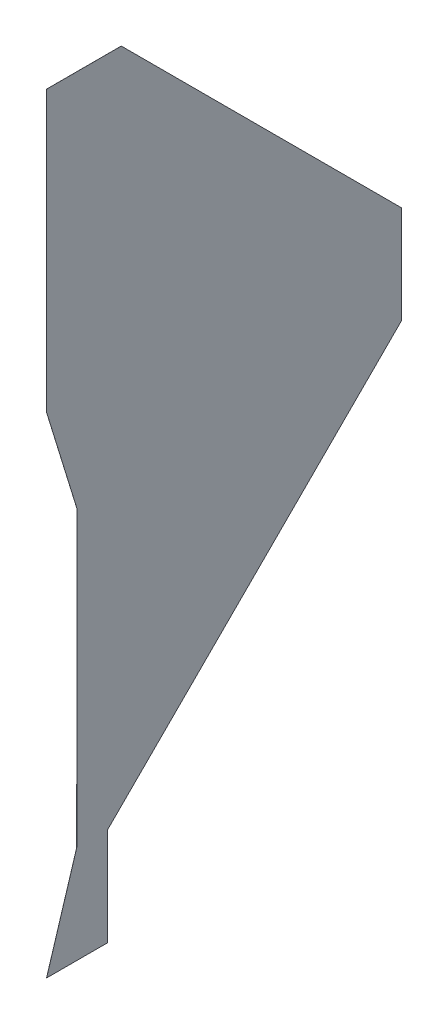
ISO-10303-21;
HEADER;
FILE_DESCRIPTION(('STEP AP214'),'2;1');
FILE_NAME('part.step','',(''),(''),'','','');
FILE_SCHEMA(('AUTOMOTIVE_DESIGN { 1 0 10303 214 1 1 1 1 }'));
ENDSEC;
DATA;
#1=APPLICATION_CONTEXT('core data for automotive mechanical design processes');
#2=APPLICATION_PROTOCOL_DEFINITION('international standard','automotive_design',2000,#1);
#3=PRODUCT_CONTEXT('',#1,'mechanical');
#4=PRODUCT('Part','Part','',(#3));
#5=PRODUCT_RELATED_PRODUCT_CATEGORY('part','',(#4));
#6=PRODUCT_DEFINITION_FORMATION('','',#4);
#7=PRODUCT_DEFINITION_CONTEXT('part definition',#1,'design');
#8=PRODUCT_DEFINITION('design','',#6,#7);
#9=PRODUCT_DEFINITION_SHAPE('','',#8);
#10=(LENGTH_UNIT() NAMED_UNIT(*) SI_UNIT(.MILLI.,.METRE.));
#11=(NAMED_UNIT(*) PLANE_ANGLE_UNIT() SI_UNIT($,.RADIAN.));
#12=(NAMED_UNIT(*) SI_UNIT($,.STERADIAN.) SOLID_ANGLE_UNIT());
#13=UNCERTAINTY_MEASURE_WITH_UNIT(LENGTH_MEASURE(1.E-05),#10,'distance_accuracy_value','');
#14=(GEOMETRIC_REPRESENTATION_CONTEXT(3) GLOBAL_UNCERTAINTY_ASSIGNED_CONTEXT((#13)) GLOBAL_UNIT_ASSIGNED_CONTEXT((#10,
#11,#12)) REPRESENTATION_CONTEXT('',''));
#15=CARTESIAN_POINT('',(0.,0.,0.));
#16=DIRECTION('',(0.,0.,1.));
#17=DIRECTION('',(1.,0.,0.));
#18=AXIS2_PLACEMENT_3D('',#15,#16,#17);
#19=CARTESIAN_POINT('',(92.300000000017,-63.468246361535,-242.836259636603));
#20=DIRECTION('',(0.,0.000285862555877771,0.999999959141299));
#21=DIRECTION('',(0.,-0.999999959141299,0.000285862555877771));
#22=AXIS2_PLACEMENT_3D('',#19,#20,#21);
#23=PLANE('',#22);
#24=DIRECTION('',(-1.,0.,0.));
#25=VECTOR('',#24,1.);
#26=CARTESIAN_POINT('',(92.300000000017,-139.647123889804,-242.814482947079));
#27=LINE('',#26,#25);
#28=CARTESIAN_POINT('',(92.310000000017,-139.647123889804,-242.814482947079));
#29=VERTEX_POINT('',#28);
#30=CARTESIAN_POINT('',(92.300000000017,-139.647123889804,-242.814482947079));
#31=VERTEX_POINT('',#30);
#32=EDGE_CURVE('E330',#29,#31,#27,.T.);
#33=ORIENTED_EDGE('',*,*,#32,.F.);
#34=DIRECTION('',(0.,-0.999999959141299,0.000285862555877771));
#35=VECTOR('',#34,1.);
#36=CARTESIAN_POINT('',(92.310000000017,-63.468246361535,-242.836259636603));
#37=LINE('',#36,#35);
#38=CARTESIAN_POINT('',(92.310000000017,-63.4871238898039,-242.836254240225));
#39=VERTEX_POINT('',#38);
#40=EDGE_CURVE('E319',#39,#29,#37,.T.);
#41=ORIENTED_EDGE('',*,*,#40,.F.);
#42=DIRECTION('',(-1.,0.,0.));
#43=VECTOR('',#42,1.);
#44=CARTESIAN_POINT('',(92.300000000017,-63.4871238898039,-242.836254240225));
#45=LINE('',#44,#43);
#46=CARTESIAN_POINT('',(92.300000000017,-63.4871238898039,-242.836254240225));
#47=VERTEX_POINT('',#46);
#48=EDGE_CURVE('E334',#39,#47,#45,.T.);
#49=ORIENTED_EDGE('',*,*,#48,.T.);
#50=DIRECTION('',(0.,-0.999999959141299,0.000285862555877771));
#51=VECTOR('',#50,1.);
#52=CARTESIAN_POINT('',(92.300000000017,-63.468246361535,-242.836259636603));
#53=LINE('',#52,#51);
#54=EDGE_CURVE('E318',#47,#31,#53,.T.);
#55=ORIENTED_EDGE('',*,*,#54,.T.);
#56=EDGE_LOOP('',(#33,#41,#49,#55));
#57=FACE_BOUND('',#56,.T.);
#58=ADVANCED_FACE('F53',(#57),#23,.T.);
#59=CARTESIAN_POINT('',(92.300000000017,-107.517123889804,-282.95964643682));
#60=DIRECTION('',(0.,-0.707106781186548,-0.707106781186547));
#61=DIRECTION('',(0.,0.707106781186547,-0.707106781186548));
#62=AXIS2_PLACEMENT_3D('',#59,#60,#61);
#63=PLANE('',#62);
#64=DIRECTION('',(-1.,0.,0.));
#65=VECTOR('',#64,1.);
#66=CARTESIAN_POINT('',(92.300000000017,-63.4871238898039,-326.98964643682));
#67=LINE('',#66,#65);
#68=CARTESIAN_POINT('',(92.310000000017,-63.4871238898039,-326.98964643682));
#69=VERTEX_POINT('',#68);
#70=CARTESIAN_POINT('',(92.300000000017,-63.4871238898039,-326.98964643682));
#71=VERTEX_POINT('',#70);
#72=EDGE_CURVE('E338',#69,#71,#67,.T.);
#73=ORIENTED_EDGE('',*,*,#72,.F.);
#74=DIRECTION('',(0.,0.707106781186547,-0.707106781186548));
#75=VECTOR('',#74,1.);
#76=CARTESIAN_POINT('',(92.310000000017,-107.517123889804,-282.95964643682));
#77=LINE('',#76,#75);
#78=CARTESIAN_POINT('',(92.310000000017,-139.647123889804,-250.82964643682));
#79=VERTEX_POINT('',#78);
#80=EDGE_CURVE('E308',#79,#69,#77,.T.);
#81=ORIENTED_EDGE('',*,*,#80,.F.);
#82=DIRECTION('',(-1.,2.80745745953666E-13,0.));
#83=VECTOR('',#82,1.);
#84=CARTESIAN_POINT('',(92.300000000017,-139.647123889804,-250.82964643682));
#85=LINE('',#84,#83);
#86=CARTESIAN_POINT('',(92.300000000017,-139.647123889804,-250.82964643682));
#87=VERTEX_POINT('',#86);
#88=EDGE_CURVE('E322',#79,#87,#85,.T.);
#89=ORIENTED_EDGE('',*,*,#88,.T.);
#90=DIRECTION('',(0.,0.707106781186547,-0.707106781186548));
#91=VECTOR('',#90,1.);
#92=CARTESIAN_POINT('',(92.300000000017,-107.517123889804,-282.95964643682));
#93=LINE('',#92,#91);
#94=EDGE_CURVE('E315',#87,#71,#93,.T.);
#95=ORIENTED_EDGE('',*,*,#94,.T.);
#96=EDGE_LOOP('',(#73,#81,#89,#95));
#97=FACE_BOUND('',#96,.T.);
#98=ADVANCED_FACE('F370',(#97),#63,.T.);
#99=CARTESIAN_POINT('',(92.300000000017,-38.1,-238.90964643682));
#100=DIRECTION('',(1.,0.,0.));
#101=DIRECTION('',(0.,1.,0.));
#102=AXIS2_PLACEMENT_3D('',#99,#100,#101);
#103=PLANE('',#102);
#104=ORIENTED_EDGE('',*,*,#54,.F.);
#105=DIRECTION('',(0.,0.967474906974961,0.252967002539442));
#106=VECTOR('',#105,1.);
#107=CARTESIAN_POINT('',(92.300000000017,-63.4871238898039,-242.836254240225));
#108=LINE('',#107,#106);
#109=CARTESIAN_POINT('',(92.300000000017,-63.463561944902,-242.83009346589));
#110=VERTEX_POINT('',#109);
#111=EDGE_CURVE('E251',#47,#110,#108,.T.);
#112=ORIENTED_EDGE('',*,*,#111,.T.);
#113=DIRECTION('',(0.,-0.95560901891625,-0.294637748711741));
#114=VECTOR('',#113,1.);
#115=CARTESIAN_POINT('',(92.300000000017,-39.1830002066171,-235.343799483297));
#116=LINE('',#115,#114);
#117=CARTESIAN_POINT('',(92.300000000017,-38.1035619449019,-235.010982135397));
#118=VERTEX_POINT('',#117);
#119=EDGE_CURVE('E241',#118,#110,#116,.T.);
#120=ORIENTED_EDGE('',*,*,#119,.F.);
#121=DIRECTION('',(0.,0.967359913062318,0.253406390211581));
#122=VECTOR('',#121,1.);
#123=CARTESIAN_POINT('',(92.300000000017,-38.103561944902,-235.010982135397));
#124=LINE('',#123,#122);
#125=CARTESIAN_POINT('',(92.300000000017,-38.08,-235.00480992656));
#126=VERTEX_POINT('',#125);
#127=EDGE_CURVE('E218',#118,#126,#124,.T.);
#128=ORIENTED_EDGE('',*,*,#127,.T.);
#129=DIRECTION('',(0.,-0.999999959141299,-0.000285862555877549));
#130=VECTOR('',#129,1.);
#131=CARTESIAN_POINT('',(92.300000000017,-38.1011162448652,-235.004815962904));
#132=LINE('',#131,#130);
#133=CARTESIAN_POINT('',(92.300000000017,34.552,-234.984047156553));
#134=VERTEX_POINT('',#133);
#135=EDGE_CURVE('E190',#134,#126,#132,.T.);
#136=ORIENTED_EDGE('',*,*,#135,.F.);
#137=DIRECTION('',(0.,0.,1.));
#138=VECTOR('',#137,1.);
#139=CARTESIAN_POINT('',(92.300000000017,34.552,-327.00964643682));
#140=LINE('',#139,#138);
#141=CARTESIAN_POINT('',(92.300000000017,34.552,-254.35764643682));
#142=VERTEX_POINT('',#141);
#143=EDGE_CURVE('E180',#142,#134,#140,.T.);
#144=ORIENTED_EDGE('',*,*,#143,.F.);
#145=DIRECTION('',(0.,0.707106781186547,0.707106781186548));
#146=VECTOR('',#145,1.);
#147=CARTESIAN_POINT('',(92.300000000017,5.94999999999998,-282.95964643682));
#148=LINE('',#147,#146);
#149=CARTESIAN_POINT('',(92.300000000017,-38.08,-326.98964643682));
#150=VERTEX_POINT('',#149);
#151=EDGE_CURVE('E174',#150,#142,#148,.T.);
#152=ORIENTED_EDGE('',*,*,#151,.F.);
#153=DIRECTION('',(0.,-0.762380675867257,-0.647128816437798));
#154=VECTOR('',#153,1.);
#155=CARTESIAN_POINT('',(92.300000000017,-38.08,-326.98964643682));
#156=LINE('',#155,#154);
#157=CARTESIAN_POINT('',(92.300000000017,-38.103561944902,-327.00964643682));
#158=VERTEX_POINT('',#157);
#159=EDGE_CURVE('E214',#150,#158,#156,.T.);
#160=ORIENTED_EDGE('',*,*,#159,.T.);
#161=DIRECTION('',(0.,1.,0.));
#162=VECTOR('',#161,1.);
#163=CARTESIAN_POINT('',(92.300000000017,-38.0835619449019,-327.00964643682));
#164=LINE('',#163,#162);
#165=CARTESIAN_POINT('',(92.300000000017,-63.463561944902,-327.00964643682));
#166=VERTEX_POINT('',#165);
#167=EDGE_CURVE('E229',#166,#158,#164,.T.);
#168=ORIENTED_EDGE('',*,*,#167,.F.);
#169=DIRECTION('',(0.,-0.762380675867861,0.647128816437086));
#170=VECTOR('',#169,1.);
#171=CARTESIAN_POINT('',(92.300000000017,-63.463561944902,-327.00964643682));
#172=LINE('',#171,#170);
#173=EDGE_CURVE('E247',#166,#71,#172,.T.);
#174=ORIENTED_EDGE('',*,*,#173,.T.);
#175=ORIENTED_EDGE('',*,*,#94,.F.);
#176=DIRECTION('',(0.,-0.762380675867256,0.647128816437798));
#177=VECTOR('',#176,1.);
#178=CARTESIAN_POINT('',(92.300000000017,-139.647123889804,-250.82964643682));
#179=LINE('',#178,#177);
#180=CARTESIAN_POINT('',(92.300000000017,-139.670685834706,-250.80964643682));
#181=VERTEX_POINT('',#180);
#182=EDGE_CURVE('E299',#87,#181,#179,.T.);
#183=ORIENTED_EDGE('',*,*,#182,.T.);
#184=DIRECTION('',(0.,1.,0.));
#185=VECTOR('',#184,1.);
#186=CARTESIAN_POINT('',(92.300000000017,-165.050685834706,-250.80964643682));
#187=LINE('',#186,#185);
#188=CARTESIAN_POINT('',(92.300000000017,-165.050685834706,-250.80964643682));
#189=VERTEX_POINT('',#188);
#190=EDGE_CURVE('E283',#189,#181,#187,.T.);
#191=ORIENTED_EDGE('',*,*,#190,.F.);
#192=DIRECTION('',(0.,0.,-1.));
#193=VECTOR('',#192,1.);
#194=CARTESIAN_POINT('',(92.300000000017,-165.050685834706,-238.90964643682));
#195=LINE('',#194,#193);
#196=CARTESIAN_POINT('',(92.300000000017,-165.050685834706,-234.983032916163));
#197=VERTEX_POINT('',#196);
#198=EDGE_CURVE('E289',#197,#189,#195,.T.);
#199=ORIENTED_EDGE('',*,*,#198,.F.);
#200=DIRECTION('',(0.,-0.95560901891625,0.294637748711741));
#201=VECTOR('',#200,1.);
#202=CARTESIAN_POINT('',(92.300000000017,-163.945114461087,-235.323907744797));
#203=LINE('',#202,#201);
#204=CARTESIAN_POINT('',(92.300000000017,-139.670685834706,-242.808310738242));
#205=VERTEX_POINT('',#204);
#206=EDGE_CURVE('E263',#205,#197,#203,.T.);
#207=ORIENTED_EDGE('',*,*,#206,.F.);
#208=DIRECTION('',(0.,0.967359913063678,-0.253406390206389));
#209=VECTOR('',#208,1.);
#210=CARTESIAN_POINT('',(92.300000000017,-139.670685834706,-242.808310738242));
#211=LINE('',#210,#209);
#212=EDGE_CURVE('E303',#205,#31,#211,.T.);
#213=ORIENTED_EDGE('',*,*,#212,.T.);
#214=EDGE_LOOP('',(#104,#112,#120,#128,#136,#144,#152,#160,#168,#174,#175,#183,#191,#199,#207,#213));
#215=FACE_BOUND('',#214,.T.);
#216=ADVANCED_FACE('F55',(#215),#103,.F.);
#217=CARTESIAN_POINT('',(92.310000000017,-63.4671238898039,-238.90964643682));
#218=DIRECTION('',(1.,0.,0.));
#219=DIRECTION('',(0.,1.,0.));
#220=AXIS2_PLACEMENT_3D('',#217,#218,#219);
#221=PLANE('',#220);
#222=ORIENTED_EDGE('',*,*,#40,.T.);
#223=DIRECTION('',(0.,0.967359913063678,-0.253406390206389));
#224=VECTOR('',#223,1.);
#225=CARTESIAN_POINT('',(92.310000000017,-139.670685834706,-242.808310738242));
#226=LINE('',#225,#224);
#227=CARTESIAN_POINT('',(92.310000000017,-139.670685834706,-242.808310738242));
#228=VERTEX_POINT('',#227);
#229=EDGE_CURVE('E304',#228,#29,#226,.T.);
#230=ORIENTED_EDGE('',*,*,#229,.F.);
#231=DIRECTION('',(0.,-0.95560901891625,0.294637748711741));
#232=VECTOR('',#231,1.);
#233=CARTESIAN_POINT('',(92.310000000017,-163.945114461087,-235.323907744797));
#234=LINE('',#233,#232);
#235=CARTESIAN_POINT('',(92.310000000017,-165.050685834706,-234.983032916163));
#236=VERTEX_POINT('',#235);
#237=EDGE_CURVE('E279',#228,#236,#234,.T.);
#238=ORIENTED_EDGE('',*,*,#237,.T.);
#239=DIRECTION('',(0.,0.,1.));
#240=VECTOR('',#239,1.);
#241=CARTESIAN_POINT('',(92.310000000017,-165.050685834706,-238.90964643682));
#242=LINE('',#241,#240);
#243=CARTESIAN_POINT('',(92.310000000017,-165.050685834706,-250.80964643682));
#244=VERTEX_POINT('',#243);
#245=EDGE_CURVE('E275',#236,#244,#242,.F.);
#246=ORIENTED_EDGE('',*,*,#245,.T.);
#247=DIRECTION('',(0.,1.,0.));
#248=VECTOR('',#247,1.);
#249=CARTESIAN_POINT('',(92.310000000017,-165.050685834706,-250.80964643682));
#250=LINE('',#249,#248);
#251=CARTESIAN_POINT('',(92.310000000017,-139.670685834706,-250.80964643682));
#252=VERTEX_POINT('',#251);
#253=EDGE_CURVE('E272',#244,#252,#250,.T.);
#254=ORIENTED_EDGE('',*,*,#253,.T.);
#255=DIRECTION('',(0.,-0.762380675867256,0.647128816437798));
#256=VECTOR('',#255,1.);
#257=CARTESIAN_POINT('',(92.310000000017,-139.647123889804,-250.82964643682));
#258=LINE('',#257,#256);
#259=EDGE_CURVE('E267',#79,#252,#258,.T.);
#260=ORIENTED_EDGE('',*,*,#259,.F.);
#261=ORIENTED_EDGE('',*,*,#80,.T.);
#262=DIRECTION('',(0.,-0.762380675867861,0.647128816437086));
#263=VECTOR('',#262,1.);
#264=CARTESIAN_POINT('',(92.3100000000169,-63.463561944902,-327.00964643682));
#265=LINE('',#264,#263);
#266=CARTESIAN_POINT('',(92.310000000017,-63.463561944902,-327.00964643682));
#267=VERTEX_POINT('',#266);
#268=EDGE_CURVE('E232',#267,#69,#265,.T.);
#269=ORIENTED_EDGE('',*,*,#268,.F.);
#270=DIRECTION('',(0.,1.,0.));
#271=VECTOR('',#270,1.);
#272=CARTESIAN_POINT('',(92.310000000017,-38.083561944902,-327.00964643682));
#273=LINE('',#272,#271);
#274=CARTESIAN_POINT('',(92.310000000017,-38.103561944902,-327.00964643682));
#275=VERTEX_POINT('',#274);
#276=EDGE_CURVE('E69',#267,#275,#273,.T.);
#277=ORIENTED_EDGE('',*,*,#276,.T.);
#278=DIRECTION('',(0.,-0.762380675867257,-0.647128816437798));
#279=VECTOR('',#278,1.);
#280=CARTESIAN_POINT('',(92.310000000017,-38.08,-326.98964643682));
#281=LINE('',#280,#279);
#282=CARTESIAN_POINT('',(92.310000000017,-38.08,-326.98964643682));
#283=VERTEX_POINT('',#282);
#284=EDGE_CURVE('E188',#283,#275,#281,.T.);
#285=ORIENTED_EDGE('',*,*,#284,.F.);
#286=DIRECTION('',(0.,0.707106781186547,0.707106781186548));
#287=VECTOR('',#286,1.);
#288=CARTESIAN_POINT('',(92.310000000017,5.94999999999998,-282.95964643682));
#289=LINE('',#288,#287);
#290=CARTESIAN_POINT('',(92.310000000017,34.552,-254.35764643682));
#291=VERTEX_POINT('',#290);
#292=EDGE_CURVE('E172',#283,#291,#289,.T.);
#293=ORIENTED_EDGE('',*,*,#292,.T.);
#294=DIRECTION('',(0.,0.,1.));
#295=VECTOR('',#294,1.);
#296=CARTESIAN_POINT('',(92.310000000017,34.552,-238.90964643682));
#297=LINE('',#296,#295);
#298=CARTESIAN_POINT('',(92.310000000017,34.552,-234.984047156553));
#299=VERTEX_POINT('',#298);
#300=EDGE_CURVE('E185',#291,#299,#297,.T.);
#301=ORIENTED_EDGE('',*,*,#300,.T.);
#302=DIRECTION('',(0.,-0.999999959141299,-0.000285862555877549));
#303=VECTOR('',#302,1.);
#304=CARTESIAN_POINT('',(92.310000000017,-38.1011162448652,-235.004815962904));
#305=LINE('',#304,#303);
#306=CARTESIAN_POINT('',(92.310000000017,-38.08,-235.00480992656));
#307=VERTEX_POINT('',#306);
#308=EDGE_CURVE('E195',#299,#307,#305,.T.);
#309=ORIENTED_EDGE('',*,*,#308,.T.);
#310=DIRECTION('',(0.,0.967359913062318,0.253406390211581));
#311=VECTOR('',#310,1.);
#312=CARTESIAN_POINT('',(92.310000000017,-38.103561944902,-235.010982135397));
#313=LINE('',#312,#311);
#314=CARTESIAN_POINT('',(92.310000000017,-38.1035619449019,-235.010982135397));
#315=VERTEX_POINT('',#314);
#316=EDGE_CURVE('E219',#315,#307,#313,.T.);
#317=ORIENTED_EDGE('',*,*,#316,.F.);
#318=DIRECTION('',(0.,-0.95560901891625,-0.294637748711741));
#319=VECTOR('',#318,1.);
#320=CARTESIAN_POINT('',(92.310000000017,-39.1830002066171,-235.343799483297));
#321=LINE('',#320,#319);
#322=CARTESIAN_POINT('',(92.3100000000169,-63.463561944902,-242.83009346589));
#323=VERTEX_POINT('',#322);
#324=EDGE_CURVE('E77',#315,#323,#321,.T.);
#325=ORIENTED_EDGE('',*,*,#324,.T.);
#326=DIRECTION('',(0.,0.967474906974961,0.252967002539442));
#327=VECTOR('',#326,1.);
#328=CARTESIAN_POINT('',(92.3100000000169,-63.4871238898039,-242.836254240225));
#329=LINE('',#328,#327);
#330=EDGE_CURVE('E252',#39,#323,#329,.T.);
#331=ORIENTED_EDGE('',*,*,#330,.F.);
#332=EDGE_LOOP('',(#222,#230,#238,#246,#254,#260,#261,#269,#277,#285,#293,#301,#309,#317,#325,#331));
#333=FACE_BOUND('',#332,.T.);
#334=ADVANCED_FACE('F184',(#333),#221,.T.);
#335=CARTESIAN_POINT('',(92.305000000017,-139.647123889804,-250.82964643682));
#336=DIRECTION('',(0.,-0.647128816437798,-0.762380675867256));
#337=DIRECTION('',(0.,-0.762380675867256,0.647128816437798));
#338=AXIS2_PLACEMENT_3D('',#335,#336,#337);
#339=PLANE('',#338);
#340=ORIENTED_EDGE('',*,*,#88,.F.);
#341=ORIENTED_EDGE('',*,*,#259,.T.);
#342=DIRECTION('',(-1.,0.,0.));
#343=VECTOR('',#342,1.);
#344=CARTESIAN_POINT('',(92.300000000017,-139.670685834706,-250.80964643682));
#345=LINE('',#344,#343);
#346=EDGE_CURVE('E256',#252,#181,#345,.T.);
#347=ORIENTED_EDGE('',*,*,#346,.T.);
#348=ORIENTED_EDGE('',*,*,#182,.F.);
#349=EDGE_LOOP('',(#340,#341,#347,#348));
#350=FACE_BOUND('',#349,.T.);
#351=ADVANCED_FACE('F380',(#350),#339,.T.);
#352=CARTESIAN_POINT('',(92.305000000017,-139.670685834706,-242.808310738242));
#353=DIRECTION('',(0.,0.253406390206389,0.967359913063678));
#354=DIRECTION('',(0.,0.967359913063678,-0.253406390206389));
#355=AXIS2_PLACEMENT_3D('',#352,#353,#354);
#356=PLANE('',#355);
#357=ORIENTED_EDGE('',*,*,#229,.T.);
#358=ORIENTED_EDGE('',*,*,#32,.T.);
#359=ORIENTED_EDGE('',*,*,#212,.F.);
#360=DIRECTION('',(-1.,0.,0.));
#361=VECTOR('',#360,1.);
#362=CARTESIAN_POINT('',(92.300000000017,-139.670685834706,-242.808310738242));
#363=LINE('',#362,#361);
#364=EDGE_CURVE('E268',#228,#205,#363,.T.);
#365=ORIENTED_EDGE('',*,*,#364,.F.);
#366=EDGE_LOOP('',(#357,#358,#359,#365));
#367=FACE_BOUND('',#366,.T.);
#368=ADVANCED_FACE('F381',(#367),#356,.T.);
#369=CARTESIAN_POINT('',(92.300000000017,-165.050685834706,-238.90964643682));
#370=DIRECTION('',(0.,-1.,0.));
#371=DIRECTION('',(0.,0.,-1.));
#372=AXIS2_PLACEMENT_3D('',#369,#370,#371);
#373=PLANE('',#372);
#374=DIRECTION('',(-1.,0.,0.));
#375=VECTOR('',#374,1.);
#376=CARTESIAN_POINT('',(92.300000000017,-165.050685834706,-250.80964643682));
#377=LINE('',#376,#375);
#378=EDGE_CURVE('E286',#244,#189,#377,.T.);
#379=ORIENTED_EDGE('',*,*,#378,.F.);
#380=ORIENTED_EDGE('',*,*,#245,.F.);
#381=DIRECTION('',(-1.,0.,0.));
#382=VECTOR('',#381,1.);
#383=CARTESIAN_POINT('',(92.300000000017,-165.050685834706,-234.983032916163));
#384=LINE('',#383,#382);
#385=EDGE_CURVE('E293',#236,#197,#384,.T.);
#386=ORIENTED_EDGE('',*,*,#385,.T.);
#387=ORIENTED_EDGE('',*,*,#198,.T.);
#388=EDGE_LOOP('',(#379,#380,#386,#387));
#389=FACE_BOUND('',#388,.T.);
#390=ADVANCED_FACE('F384',(#389),#373,.T.);
#391=CARTESIAN_POINT('',(92.300000000017,-165.050685834706,-250.80964643682));
#392=DIRECTION('',(0.,0.,-1.));
#393=DIRECTION('',(0.,1.,0.));
#394=AXIS2_PLACEMENT_3D('',#391,#392,#393);
#395=PLANE('',#394);
#396=ORIENTED_EDGE('',*,*,#346,.F.);
#397=ORIENTED_EDGE('',*,*,#253,.F.);
#398=ORIENTED_EDGE('',*,*,#378,.T.);
#399=ORIENTED_EDGE('',*,*,#190,.T.);
#400=EDGE_LOOP('',(#396,#397,#398,#399));
#401=FACE_BOUND('',#400,.T.);
#402=ADVANCED_FACE('F393',(#401),#395,.T.);
#403=CARTESIAN_POINT('',(92.300000000017,-163.945114461087,-235.323907744797));
#404=DIRECTION('',(0.,0.294637748711741,0.95560901891625));
#405=DIRECTION('',(0.,-0.95560901891625,0.294637748711741));
#406=AXIS2_PLACEMENT_3D('',#403,#404,#405);
#407=PLANE('',#406);
#408=ORIENTED_EDGE('',*,*,#385,.F.);
#409=ORIENTED_EDGE('',*,*,#237,.F.);
#410=ORIENTED_EDGE('',*,*,#364,.T.);
#411=ORIENTED_EDGE('',*,*,#206,.T.);
#412=EDGE_LOOP('',(#408,#409,#410,#411));
#413=FACE_BOUND('',#412,.T.);
#414=ADVANCED_FACE('F389',(#413),#407,.T.);
#415=CARTESIAN_POINT('',(92.3050000000169,-63.463561944902,-327.00964643682));
#416=DIRECTION('',(0.,-0.647128816437086,-0.762380675867861));
#417=DIRECTION('',(0.,-0.762380675867861,0.647128816437086));
#418=AXIS2_PLACEMENT_3D('',#415,#416,#417);
#419=PLANE('',#418);
#420=DIRECTION('',(-1.,-6.93728578126605E-13,0.));
#421=VECTOR('',#420,1.);
#422=CARTESIAN_POINT('',(92.300000000017,-63.463561944902,-327.00964643682));
#423=LINE('',#422,#421);
#424=EDGE_CURVE('E233',#267,#166,#423,.T.);
#425=ORIENTED_EDGE('',*,*,#424,.F.);
#426=ORIENTED_EDGE('',*,*,#268,.T.);
#427=ORIENTED_EDGE('',*,*,#72,.T.);
#428=ORIENTED_EDGE('',*,*,#173,.F.);
#429=EDGE_LOOP('',(#425,#426,#427,#428));
#430=FACE_BOUND('',#429,.T.);
#431=ADVANCED_FACE('F392',(#430),#419,.T.);
#432=CARTESIAN_POINT('',(92.305000000017,-63.4871238898039,-242.836254240225));
#433=DIRECTION('',(0.,-0.252967002539442,0.967474906974961));
#434=DIRECTION('',(0.,0.967474906974961,0.252967002539442));
#435=AXIS2_PLACEMENT_3D('',#432,#433,#434);
#436=PLANE('',#435);
#437=ORIENTED_EDGE('',*,*,#330,.T.);
#438=DIRECTION('',(-1.,0.,0.));
#439=VECTOR('',#438,1.);
#440=CARTESIAN_POINT('',(92.300000000017,-63.463561944902,-242.83009346589));
#441=LINE('',#440,#439);
#442=EDGE_CURVE('E223',#323,#110,#441,.T.);
#443=ORIENTED_EDGE('',*,*,#442,.T.);
#444=ORIENTED_EDGE('',*,*,#111,.F.);
#445=ORIENTED_EDGE('',*,*,#48,.F.);
#446=EDGE_LOOP('',(#437,#443,#444,#445));
#447=FACE_BOUND('',#446,.T.);
#448=ADVANCED_FACE('F355',(#447),#436,.T.);
#449=CARTESIAN_POINT('',(92.300000000017,-39.1830002066171,-235.343799483297));
#450=DIRECTION('',(0.,-0.294637748711741,0.95560901891625));
#451=DIRECTION('',(0.,-0.95560901891625,-0.294637748711741));
#452=AXIS2_PLACEMENT_3D('',#449,#450,#451);
#453=PLANE('',#452);
#454=ORIENTED_EDGE('',*,*,#442,.F.);
#455=ORIENTED_EDGE('',*,*,#324,.F.);
#456=DIRECTION('',(-1.,0.,0.));
#457=VECTOR('',#456,1.);
#458=CARTESIAN_POINT('',(92.300000000017,-38.1035619449019,-235.010982135397));
#459=LINE('',#458,#457);
#460=EDGE_CURVE('E62',#315,#118,#459,.T.);
#461=ORIENTED_EDGE('',*,*,#460,.T.);
#462=ORIENTED_EDGE('',*,*,#119,.T.);
#463=EDGE_LOOP('',(#454,#455,#461,#462));
#464=FACE_BOUND('',#463,.T.);
#465=ADVANCED_FACE('F345',(#464),#453,.T.);
#466=CARTESIAN_POINT('',(92.300000000017,-38.0835619449019,-327.00964643682));
#467=DIRECTION('',(0.,0.,-1.));
#468=DIRECTION('',(0.,1.,0.));
#469=AXIS2_PLACEMENT_3D('',#466,#467,#468);
#470=PLANE('',#469);
#471=DIRECTION('',(-1.,0.,0.));
#472=VECTOR('',#471,1.);
#473=CARTESIAN_POINT('',(92.300000000017,-38.103561944902,-327.00964643682));
#474=LINE('',#473,#472);
#475=EDGE_CURVE('E12',#275,#158,#474,.T.);
#476=ORIENTED_EDGE('',*,*,#475,.F.);
#477=ORIENTED_EDGE('',*,*,#276,.F.);
#478=ORIENTED_EDGE('',*,*,#424,.T.);
#479=ORIENTED_EDGE('',*,*,#167,.T.);
#480=EDGE_LOOP('',(#476,#477,#478,#479));
#481=FACE_BOUND('',#480,.T.);
#482=ADVANCED_FACE('F406',(#481),#470,.T.);
#483=CARTESIAN_POINT('',(92.305000000017,-38.08,-326.98964643682));
#484=DIRECTION('',(0.,0.647128816437798,-0.762380675867257));
#485=DIRECTION('',(0.,-0.762380675867257,-0.647128816437798));
#486=AXIS2_PLACEMENT_3D('',#483,#484,#485);
#487=PLANE('',#486);
#488=DIRECTION('',(-1.,4.89897185318294E-13,0.));
#489=VECTOR('',#488,1.);
#490=CARTESIAN_POINT('',(92.300000000017,-38.08,-326.98964643682));
#491=LINE('',#490,#489);
#492=EDGE_CURVE('E202',#283,#150,#491,.T.);
#493=ORIENTED_EDGE('',*,*,#492,.F.);
#494=ORIENTED_EDGE('',*,*,#284,.T.);
#495=ORIENTED_EDGE('',*,*,#475,.T.);
#496=ORIENTED_EDGE('',*,*,#159,.F.);
#497=EDGE_LOOP('',(#493,#494,#495,#496));
#498=FACE_BOUND('',#497,.T.);
#499=ADVANCED_FACE('F409',(#498),#487,.T.);
#500=CARTESIAN_POINT('',(92.305000000017,-38.103561944902,-235.010982135397));
#501=DIRECTION('',(0.,-0.253406390211581,0.967359913062318));
#502=DIRECTION('',(0.,0.967359913062318,0.253406390211581));
#503=AXIS2_PLACEMENT_3D('',#500,#501,#502);
#504=PLANE('',#503);
#505=ORIENTED_EDGE('',*,*,#316,.T.);
#506=DIRECTION('',(-1.,0.,0.));
#507=VECTOR('',#506,1.);
#508=CARTESIAN_POINT('',(92.300000000017,-38.08,-235.00480992656));
#509=LINE('',#508,#507);
#510=EDGE_CURVE('E181',#307,#126,#509,.T.);
#511=ORIENTED_EDGE('',*,*,#510,.T.);
#512=ORIENTED_EDGE('',*,*,#127,.F.);
#513=ORIENTED_EDGE('',*,*,#460,.F.);
#514=EDGE_LOOP('',(#505,#511,#512,#513));
#515=FACE_BOUND('',#514,.T.);
#516=ADVANCED_FACE('F348',(#515),#504,.T.);
#517=CARTESIAN_POINT('',(92.300000000017,34.552,-327.00964643682));
#518=DIRECTION('',(0.,1.,0.));
#519=DIRECTION('',(0.,0.,1.));
#520=AXIS2_PLACEMENT_3D('',#517,#518,#519);
#521=PLANE('',#520);
#522=DIRECTION('',(-1.,0.,0.));
#523=VECTOR('',#522,1.);
#524=CARTESIAN_POINT('',(92.300000000017,34.552,-234.984047156553));
#525=LINE('',#524,#523);
#526=EDGE_CURVE('E193',#299,#134,#525,.T.);
#527=ORIENTED_EDGE('',*,*,#526,.F.);
#528=ORIENTED_EDGE('',*,*,#300,.F.);
#529=DIRECTION('',(-1.,0.,0.));
#530=VECTOR('',#529,1.);
#531=CARTESIAN_POINT('',(92.300000000017,34.552,-254.35764643682));
#532=LINE('',#531,#530);
#533=EDGE_CURVE('E168',#291,#142,#532,.T.);
#534=ORIENTED_EDGE('',*,*,#533,.T.);
#535=ORIENTED_EDGE('',*,*,#143,.T.);
#536=EDGE_LOOP('',(#527,#528,#534,#535));
#537=FACE_BOUND('',#536,.T.);
#538=ADVANCED_FACE('F192',(#537),#521,.T.);
#539=CARTESIAN_POINT('',(92.300000000017,-38.1011162448652,-235.004815962904));
#540=DIRECTION('',(0.,-0.000285862555877549,0.999999959141299));
#541=DIRECTION('',(0.,-0.999999959141299,-0.000285862555877549));
#542=AXIS2_PLACEMENT_3D('',#539,#540,#541);
#543=PLANE('',#542);
#544=ORIENTED_EDGE('',*,*,#510,.F.);
#545=ORIENTED_EDGE('',*,*,#308,.F.);
#546=ORIENTED_EDGE('',*,*,#526,.T.);
#547=ORIENTED_EDGE('',*,*,#135,.T.);
#548=EDGE_LOOP('',(#544,#545,#546,#547));
#549=FACE_BOUND('',#548,.T.);
#550=ADVANCED_FACE('F360',(#549),#543,.T.);
#551=CARTESIAN_POINT('',(92.300000000017,5.94999999999998,-282.95964643682));
#552=DIRECTION('',(0.,0.707106781186548,-0.707106781186547));
#553=DIRECTION('',(0.,0.707106781186547,0.707106781186548));
#554=AXIS2_PLACEMENT_3D('',#551,#552,#553);
#555=PLANE('',#554);
#556=ORIENTED_EDGE('',*,*,#533,.F.);
#557=ORIENTED_EDGE('',*,*,#292,.F.);
#558=ORIENTED_EDGE('',*,*,#492,.T.);
#559=ORIENTED_EDGE('',*,*,#151,.T.);
#560=EDGE_LOOP('',(#556,#557,#558,#559));
#561=FACE_BOUND('',#560,.T.);
#562=ADVANCED_FACE('F170',(#561),#555,.T.);
#563=CLOSED_SHELL('',(#58,#98,#216,#334,#351,#368,#390,#402,#414,#431,#448,#465,#482,#499,#516,
#538,#550,#562));
#564=MANIFOLD_SOLID_BREP('B2',#563);
#565=ADVANCED_BREP_SHAPE_REPRESENTATION('',(#18,#564),#14);
#566=SHAPE_DEFINITION_REPRESENTATION(#9,#565);
ENDSEC;
END-ISO-10303-21;
